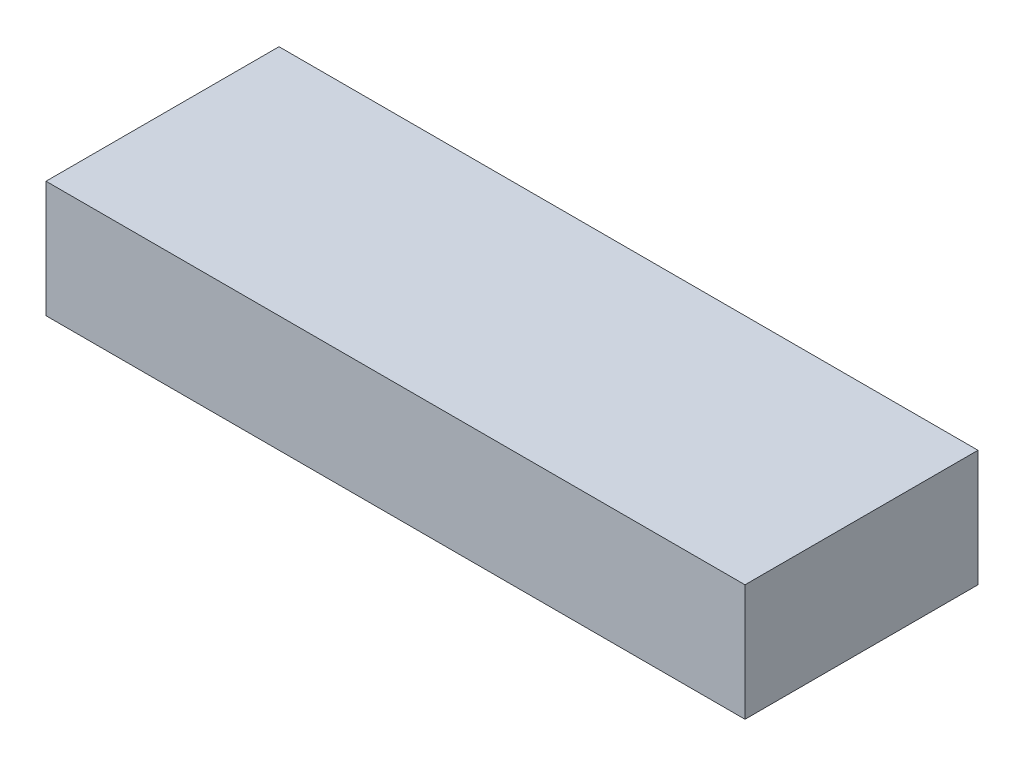
ISO-10303-21;
HEADER;
FILE_DESCRIPTION(('STEP AP214'),'2;1');
FILE_NAME('part.step','',(''),(''),'','','');
FILE_SCHEMA(('AUTOMOTIVE_DESIGN { 1 0 10303 214 1 1 1 1 }'));
ENDSEC;
DATA;
#1=APPLICATION_CONTEXT('core data for automotive mechanical design processes');
#2=APPLICATION_PROTOCOL_DEFINITION('international standard','automotive_design',2000,#1);
#3=PRODUCT_CONTEXT('',#1,'mechanical');
#4=PRODUCT('Part','Part','',(#3));
#5=PRODUCT_RELATED_PRODUCT_CATEGORY('part','',(#4));
#6=PRODUCT_DEFINITION_FORMATION('','',#4);
#7=PRODUCT_DEFINITION_CONTEXT('part definition',#1,'design');
#8=PRODUCT_DEFINITION('design','',#6,#7);
#9=PRODUCT_DEFINITION_SHAPE('','',#8);
#10=(LENGTH_UNIT() NAMED_UNIT(*) SI_UNIT(.MILLI.,.METRE.));
#11=(NAMED_UNIT(*) PLANE_ANGLE_UNIT() SI_UNIT($,.RADIAN.));
#12=(NAMED_UNIT(*) SI_UNIT($,.STERADIAN.) SOLID_ANGLE_UNIT());
#13=UNCERTAINTY_MEASURE_WITH_UNIT(LENGTH_MEASURE(1.E-05),#10,'distance_accuracy_value','');
#14=(GEOMETRIC_REPRESENTATION_CONTEXT(3) GLOBAL_UNCERTAINTY_ASSIGNED_CONTEXT((#13)) GLOBAL_UNIT_ASSIGNED_CONTEXT((#10,
#11,#12)) REPRESENTATION_CONTEXT('',''));
#15=CARTESIAN_POINT('',(0.,0.,0.));
#16=DIRECTION('',(0.,0.,1.));
#17=DIRECTION('',(1.,0.,0.));
#18=AXIS2_PLACEMENT_3D('',#15,#16,#17);
#19=CARTESIAN_POINT('',(0.,25.4,0.));
#20=DIRECTION('',(1.,0.,0.));
#21=DIRECTION('',(0.,0.,-1.));
#22=AXIS2_PLACEMENT_3D('',#19,#20,#21);
#23=PLANE('',#22);
#24=DIRECTION('',(0.,0.,1.));
#25=VECTOR('',#24,1.);
#26=CARTESIAN_POINT('',(0.,0.,0.));
#27=LINE('',#26,#25);
#28=CARTESIAN_POINT('',(0.,0.,-50.8));
#29=VERTEX_POINT('',#28);
#30=CARTESIAN_POINT('',(0.,0.,0.));
#31=VERTEX_POINT('',#30);
#32=EDGE_CURVE('E97',#29,#31,#27,.T.);
#33=ORIENTED_EDGE('',*,*,#32,.T.);
#34=DIRECTION('',(0.,-1.,0.));
#35=VECTOR('',#34,1.);
#36=CARTESIAN_POINT('',(0.,25.4,0.));
#37=LINE('',#36,#35);
#38=CARTESIAN_POINT('',(0.,25.4,0.));
#39=VERTEX_POINT('',#38);
#40=EDGE_CURVE('E11',#39,#31,#37,.T.);
#41=ORIENTED_EDGE('',*,*,#40,.F.);
#42=DIRECTION('',(0.,0.,1.));
#43=VECTOR('',#42,1.);
#44=CARTESIAN_POINT('',(0.,25.4,0.));
#45=LINE('',#44,#43);
#46=CARTESIAN_POINT('',(0.,25.4,-50.8));
#47=VERTEX_POINT('',#46);
#48=EDGE_CURVE('E85',#47,#39,#45,.T.);
#49=ORIENTED_EDGE('',*,*,#48,.F.);
#50=DIRECTION('',(0.,-1.,0.));
#51=VECTOR('',#50,1.);
#52=CARTESIAN_POINT('',(0.,25.4,-50.8));
#53=LINE('',#52,#51);
#54=EDGE_CURVE('E93',#47,#29,#53,.T.);
#55=ORIENTED_EDGE('',*,*,#54,.T.);
#56=EDGE_LOOP('',(#33,#41,#49,#55));
#57=FACE_BOUND('',#56,.T.);
#58=ADVANCED_FACE('F34',(#57),#23,.F.);
#59=CARTESIAN_POINT('',(0.,25.4,0.));
#60=DIRECTION('',(0.,0.,-1.));
#61=DIRECTION('',(-1.,0.,0.));
#62=AXIS2_PLACEMENT_3D('',#59,#60,#61);
#63=PLANE('',#62);
#64=DIRECTION('',(1.,0.,0.));
#65=VECTOR('',#64,1.);
#66=CARTESIAN_POINT('',(0.,0.,0.));
#67=LINE('',#66,#65);
#68=CARTESIAN_POINT('',(152.4,0.,0.));
#69=VERTEX_POINT('',#68);
#70=EDGE_CURVE('E89',#31,#69,#67,.T.);
#71=ORIENTED_EDGE('',*,*,#70,.T.);
#72=DIRECTION('',(0.,-1.,0.));
#73=VECTOR('',#72,1.);
#74=CARTESIAN_POINT('',(152.4,25.4,0.));
#75=LINE('',#74,#73);
#76=CARTESIAN_POINT('',(152.4,25.4,0.));
#77=VERTEX_POINT('',#76);
#78=EDGE_CURVE('E42',#77,#69,#75,.T.);
#79=ORIENTED_EDGE('',*,*,#78,.F.);
#80=DIRECTION('',(1.,0.,0.));
#81=VECTOR('',#80,1.);
#82=CARTESIAN_POINT('',(0.,25.4,0.));
#83=LINE('',#82,#81);
#84=EDGE_CURVE('E80',#39,#77,#83,.T.);
#85=ORIENTED_EDGE('',*,*,#84,.F.);
#86=ORIENTED_EDGE('',*,*,#40,.T.);
#87=EDGE_LOOP('',(#71,#79,#85,#86));
#88=FACE_BOUND('',#87,.T.);
#89=ADVANCED_FACE('F88',(#88),#63,.F.);
#90=CARTESIAN_POINT('',(152.4,25.4,0.));
#91=DIRECTION('',(-1.,0.,0.));
#92=DIRECTION('',(0.,0.,1.));
#93=AXIS2_PLACEMENT_3D('',#90,#91,#92);
#94=PLANE('',#93);
#95=DIRECTION('',(0.,0.,-1.));
#96=VECTOR('',#95,1.);
#97=CARTESIAN_POINT('',(152.4,0.,0.));
#98=LINE('',#97,#96);
#99=CARTESIAN_POINT('',(152.4,0.,-50.8));
#100=VERTEX_POINT('',#99);
#101=EDGE_CURVE('E67',#69,#100,#98,.T.);
#102=ORIENTED_EDGE('',*,*,#101,.T.);
#103=DIRECTION('',(0.,-1.,0.));
#104=VECTOR('',#103,1.);
#105=CARTESIAN_POINT('',(152.4,25.4,-50.8));
#106=LINE('',#105,#104);
#107=CARTESIAN_POINT('',(152.4,25.4,-50.8));
#108=VERTEX_POINT('',#107);
#109=EDGE_CURVE('E90',#108,#100,#106,.T.);
#110=ORIENTED_EDGE('',*,*,#109,.F.);
#111=DIRECTION('',(0.,0.,-1.));
#112=VECTOR('',#111,1.);
#113=CARTESIAN_POINT('',(152.4,25.4,0.));
#114=LINE('',#113,#112);
#115=EDGE_CURVE('E83',#77,#108,#114,.T.);
#116=ORIENTED_EDGE('',*,*,#115,.F.);
#117=ORIENTED_EDGE('',*,*,#78,.T.);
#118=EDGE_LOOP('',(#102,#110,#116,#117));
#119=FACE_BOUND('',#118,.T.);
#120=ADVANCED_FACE('F91',(#119),#94,.F.);
#121=CARTESIAN_POINT('',(0.,25.4,-50.8));
#122=DIRECTION('',(0.,0.,1.));
#123=DIRECTION('',(1.,0.,0.));
#124=AXIS2_PLACEMENT_3D('',#121,#122,#123);
#125=PLANE('',#124);
#126=DIRECTION('',(-1.,0.,0.));
#127=VECTOR('',#126,1.);
#128=CARTESIAN_POINT('',(0.,0.,-50.8));
#129=LINE('',#128,#127);
#130=EDGE_CURVE('E73',#100,#29,#129,.T.);
#131=ORIENTED_EDGE('',*,*,#130,.T.);
#132=ORIENTED_EDGE('',*,*,#54,.F.);
#133=DIRECTION('',(-1.,0.,0.));
#134=VECTOR('',#133,1.);
#135=CARTESIAN_POINT('',(0.,25.4,-50.8));
#136=LINE('',#135,#134);
#137=EDGE_CURVE('E50',#108,#47,#136,.T.);
#138=ORIENTED_EDGE('',*,*,#137,.F.);
#139=ORIENTED_EDGE('',*,*,#109,.T.);
#140=EDGE_LOOP('',(#131,#132,#138,#139));
#141=FACE_BOUND('',#140,.T.);
#142=ADVANCED_FACE('F104',(#141),#125,.F.);
#143=CARTESIAN_POINT('',(0.,25.4,-50.8));
#144=DIRECTION('',(0.,-1.,0.));
#145=DIRECTION('',(0.,0.,-1.));
#146=AXIS2_PLACEMENT_3D('',#143,#144,#145);
#147=PLANE('',#146);
#148=ORIENTED_EDGE('',*,*,#48,.T.);
#149=ORIENTED_EDGE('',*,*,#84,.T.);
#150=ORIENTED_EDGE('',*,*,#115,.T.);
#151=ORIENTED_EDGE('',*,*,#137,.T.);
#152=EDGE_LOOP('',(#148,#149,#150,#151));
#153=FACE_BOUND('',#152,.T.);
#154=ADVANCED_FACE('F81',(#153),#147,.F.);
#155=CARTESIAN_POINT('',(0.,0.,-50.8));
#156=DIRECTION('',(0.,-1.,0.));
#157=DIRECTION('',(0.,0.,-1.));
#158=AXIS2_PLACEMENT_3D('',#155,#156,#157);
#159=PLANE('',#158);
#160=ORIENTED_EDGE('',*,*,#32,.F.);
#161=ORIENTED_EDGE('',*,*,#130,.F.);
#162=ORIENTED_EDGE('',*,*,#101,.F.);
#163=ORIENTED_EDGE('',*,*,#70,.F.);
#164=EDGE_LOOP('',(#160,#161,#162,#163));
#165=FACE_BOUND('',#164,.T.);
#166=ADVANCED_FACE('F107',(#165),#159,.T.);
#167=CLOSED_SHELL('',(#58,#89,#120,#142,#154,#166));
#168=MANIFOLD_SOLID_BREP('B2',#167);
#169=ADVANCED_BREP_SHAPE_REPRESENTATION('',(#18,#168),#14);
#170=SHAPE_DEFINITION_REPRESENTATION(#9,#169);
ENDSEC;
END-ISO-10303-21;
